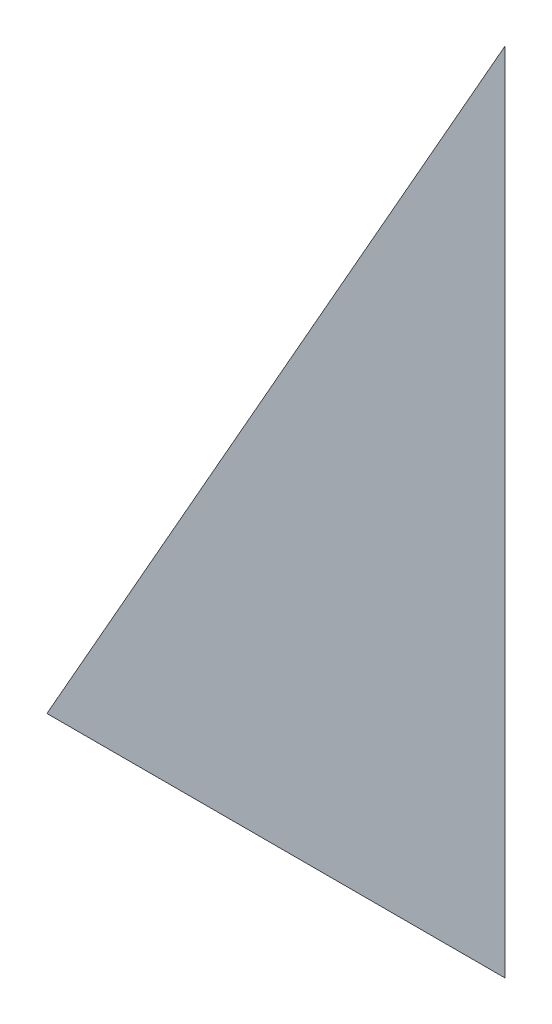
ISO-10303-21;
HEADER;
FILE_DESCRIPTION(('STEP AP214'),'2;1');
FILE_NAME('part.step','',(''),(''),'','','');
FILE_SCHEMA(('AUTOMOTIVE_DESIGN { 1 0 10303 214 1 1 1 1 }'));
ENDSEC;
DATA;
#1=APPLICATION_CONTEXT('core data for automotive mechanical design processes');
#2=APPLICATION_PROTOCOL_DEFINITION('international standard','automotive_design',2000,#1);
#3=PRODUCT_CONTEXT('',#1,'mechanical');
#4=PRODUCT('Part','Part','',(#3));
#5=PRODUCT_RELATED_PRODUCT_CATEGORY('part','',(#4));
#6=PRODUCT_DEFINITION_FORMATION('','',#4);
#7=PRODUCT_DEFINITION_CONTEXT('part definition',#1,'design');
#8=PRODUCT_DEFINITION('design','',#6,#7);
#9=PRODUCT_DEFINITION_SHAPE('','',#8);
#10=(LENGTH_UNIT() NAMED_UNIT(*) SI_UNIT(.MILLI.,.METRE.));
#11=(NAMED_UNIT(*) PLANE_ANGLE_UNIT() SI_UNIT($,.RADIAN.));
#12=(NAMED_UNIT(*) SI_UNIT($,.STERADIAN.) SOLID_ANGLE_UNIT());
#13=UNCERTAINTY_MEASURE_WITH_UNIT(LENGTH_MEASURE(1.E-05),#10,'distance_accuracy_value','');
#14=(GEOMETRIC_REPRESENTATION_CONTEXT(3) GLOBAL_UNCERTAINTY_ASSIGNED_CONTEXT((#13)) GLOBAL_UNIT_ASSIGNED_CONTEXT((#10,
#11,#12)) REPRESENTATION_CONTEXT('',''));
#15=CARTESIAN_POINT('',(0.,0.,0.));
#16=DIRECTION('',(0.,0.,1.));
#17=DIRECTION('',(1.,0.,0.));
#18=AXIS2_PLACEMENT_3D('',#15,#16,#17);
#19=CARTESIAN_POINT('',(5.831546917493,0.90173548029,0.001332));
#20=DIRECTION('',(0.,0.,1.));
#21=DIRECTION('',(1.,0.,0.));
#22=AXIS2_PLACEMENT_3D('',#19,#20,#21);
#23=PLANE('',#22);
#24=CARTESIAN_POINT('',(5.860369157796,0.998861007108,0.001668));
#25=DIRECTION('',(-0.493634188530103,-0.869669642976129,0.));
#26=VECTOR('',#25,1.);
#27=LINE('',#24,#26);
#28=CARTESIAN_POINT('',(5.860369157796,0.998861007108,0.0015));
#29=VERTEX_POINT('',#28);
#30=CARTESIAN_POINT('',(5.769161134488,0.838173496174,0.0015));
#31=VERTEX_POINT('',#30);
#32=EDGE_CURVE('E11',#29,#31,#27,.T.);
#33=ORIENTED_EDGE('',*,*,#32,.F.);
#34=CARTESIAN_POINT('',(5.860369157796,0.838173496174,0.001668));
#35=DIRECTION('',(0.,1.,0.));
#36=VECTOR('',#35,1.);
#37=LINE('',#34,#36);
#38=CARTESIAN_POINT('',(5.860369157796,0.838173496174,0.0015));
#39=VERTEX_POINT('',#38);
#40=EDGE_CURVE('E28',#39,#29,#37,.T.);
#41=ORIENTED_EDGE('',*,*,#40,.F.);
#42=CARTESIAN_POINT('',(5.769161134488,0.838173496174,0.001668));
#43=DIRECTION('',(1.,0.,0.));
#44=VECTOR('',#43,1.);
#45=LINE('',#42,#44);
#46=EDGE_CURVE('E39',#31,#39,#45,.T.);
#47=ORIENTED_EDGE('',*,*,#46,.F.);
#48=EDGE_LOOP('',(#33,#41,#47));
#49=FACE_BOUND('',#48,.T.);
#50=ADVANCED_FACE('F17',(#49),#23,.F.);
#51=CARTESIAN_POINT('',(5.831546917493,0.90173548029,0.001668));
#52=DIRECTION('',(0.,0.,1.));
#53=DIRECTION('',(1.,0.,0.));
#54=AXIS2_PLACEMENT_3D('',#51,#52,#53);
#55=PLANE('',#54);
#56=ORIENTED_EDGE('',*,*,#40,.T.);
#57=ORIENTED_EDGE('',*,*,#32,.T.);
#58=ORIENTED_EDGE('',*,*,#46,.T.);
#59=EDGE_LOOP('',(#56,#57,#58));
#60=FACE_BOUND('',#59,.T.);
#61=ADVANCED_FACE('F44',(#60),#55,.T.);
#62=CLOSED_SHELL('',(#50,#61));
#63=MANIFOLD_SOLID_BREP('B1',#62);
#64=ADVANCED_BREP_SHAPE_REPRESENTATION('',(#18,#63),#14);
#65=SHAPE_DEFINITION_REPRESENTATION(#9,#64);
ENDSEC;
END-ISO-10303-21;
